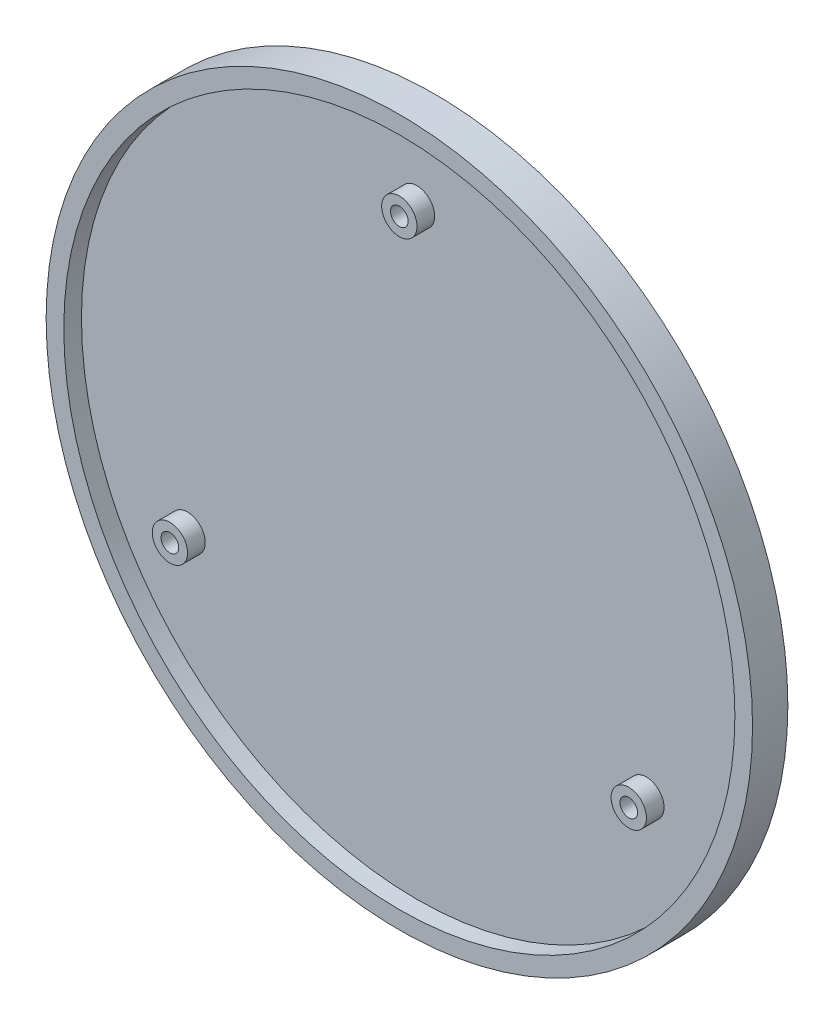
ISO-10303-21;
HEADER;
FILE_DESCRIPTION(('STEP AP214'),'2;1');
FILE_NAME('part.step','',(''),(''),'','','');
FILE_SCHEMA(('AUTOMOTIVE_DESIGN { 1 0 10303 214 1 1 1 1 }'));
ENDSEC;
DATA;
#1=APPLICATION_CONTEXT('core data for automotive mechanical design processes');
#2=APPLICATION_PROTOCOL_DEFINITION('international standard','automotive_design',2000,#1);
#3=PRODUCT_CONTEXT('',#1,'mechanical');
#4=PRODUCT('Part','Part','',(#3));
#5=PRODUCT_RELATED_PRODUCT_CATEGORY('part','',(#4));
#6=PRODUCT_DEFINITION_FORMATION('','',#4);
#7=PRODUCT_DEFINITION_CONTEXT('part definition',#1,'design');
#8=PRODUCT_DEFINITION('design','',#6,#7);
#9=PRODUCT_DEFINITION_SHAPE('','',#8);
#10=(LENGTH_UNIT() NAMED_UNIT(*) SI_UNIT(.MILLI.,.METRE.));
#11=(NAMED_UNIT(*) PLANE_ANGLE_UNIT() SI_UNIT($,.RADIAN.));
#12=(NAMED_UNIT(*) SI_UNIT($,.STERADIAN.) SOLID_ANGLE_UNIT());
#13=UNCERTAINTY_MEASURE_WITH_UNIT(LENGTH_MEASURE(1.E-05),#10,'distance_accuracy_value','');
#14=(GEOMETRIC_REPRESENTATION_CONTEXT(3) GLOBAL_UNCERTAINTY_ASSIGNED_CONTEXT((#13)) GLOBAL_UNIT_ASSIGNED_CONTEXT((#10,
#11,#12)) REPRESENTATION_CONTEXT('',''));
#15=CARTESIAN_POINT('',(0.,0.,0.));
#16=DIRECTION('',(0.,0.,1.));
#17=DIRECTION('',(1.,0.,0.));
#18=AXIS2_PLACEMENT_3D('',#15,#16,#17);
#19=CARTESIAN_POINT('',(0.,30.,4.));
#20=DIRECTION('',(0.,0.,-1.));
#21=DIRECTION('',(-1.,0.,0.));
#22=AXIS2_PLACEMENT_3D('',#19,#20,#21);
#23=CYLINDRICAL_SURFACE('',#22,1.);
#24=CARTESIAN_POINT('',(0.,30.,4.));
#25=DIRECTION('',(0.,0.,1.));
#26=DIRECTION('',(1.,0.,0.));
#27=AXIS2_PLACEMENT_3D('',#24,#25,#26);
#28=CIRCLE('',#27,1.);
#29=CARTESIAN_POINT('',(1.,30.,4.));
#30=VERTEX_POINT('',#29);
#31=EDGE_CURVE('E97',#30,#30,#28,.T.);
#32=ORIENTED_EDGE('',*,*,#31,.T.);
#33=EDGE_LOOP('',(#32));
#34=FACE_BOUND('',#33,.T.);
#35=CARTESIAN_POINT('',(0.,30.,1.2));
#36=DIRECTION('',(0.,0.,-1.));
#37=DIRECTION('',(-1.,0.,0.));
#38=AXIS2_PLACEMENT_3D('',#35,#36,#37);
#39=CIRCLE('',#38,1.);
#40=CARTESIAN_POINT('',(-1.,30.,1.2));
#41=VERTEX_POINT('',#40);
#42=EDGE_CURVE('E41',#41,#41,#39,.T.);
#43=ORIENTED_EDGE('',*,*,#42,.T.);
#44=EDGE_LOOP('',(#43));
#45=FACE_BOUND('',#44,.T.);
#46=ADVANCED_FACE('F37',(#34,#45),#23,.F.);
#47=CARTESIAN_POINT('',(25.9807621135364,-14.9999999999981,4.));
#48=DIRECTION('',(0.,0.,-1.));
#49=DIRECTION('',(-1.,0.,0.));
#50=AXIS2_PLACEMENT_3D('',#47,#48,#49);
#51=CYLINDRICAL_SURFACE('',#50,1.00000000000267);
#52=CARTESIAN_POINT('',(25.9807621135364,-14.9999999999981,4.));
#53=DIRECTION('',(0.,0.,1.));
#54=DIRECTION('',(1.,0.,0.));
#55=AXIS2_PLACEMENT_3D('',#52,#53,#54);
#56=CIRCLE('',#55,1.00000000000267);
#57=CARTESIAN_POINT('',(26.980762113539,-14.9999999999981,4.));
#58=VERTEX_POINT('',#57);
#59=EDGE_CURVE('E87',#58,#58,#56,.T.);
#60=ORIENTED_EDGE('',*,*,#59,.T.);
#61=EDGE_LOOP('',(#60));
#62=FACE_BOUND('',#61,.T.);
#63=CARTESIAN_POINT('',(25.9807621135364,-14.9999999999981,1.2));
#64=DIRECTION('',(0.,0.,-1.));
#65=DIRECTION('',(-1.,0.,0.));
#66=AXIS2_PLACEMENT_3D('',#63,#64,#65);
#67=CIRCLE('',#66,1.00000000000267);
#68=CARTESIAN_POINT('',(24.9807621135337,-14.9999999999981,1.2));
#69=VERTEX_POINT('',#68);
#70=EDGE_CURVE('E60',#69,#69,#67,.T.);
#71=ORIENTED_EDGE('',*,*,#70,.T.);
#72=EDGE_LOOP('',(#71));
#73=FACE_BOUND('',#72,.T.);
#74=ADVANCED_FACE('F136',(#62,#73),#51,.F.);
#75=CARTESIAN_POINT('',(-25.98076211353,-15.0000000000019,4.));
#76=DIRECTION('',(0.,0.,-1.));
#77=DIRECTION('',(-1.,0.,0.));
#78=AXIS2_PLACEMENT_3D('',#75,#76,#77);
#79=CYLINDRICAL_SURFACE('',#78,1.00000000000387);
#80=CARTESIAN_POINT('',(-25.98076211353,-15.0000000000019,4.));
#81=DIRECTION('',(0.,0.,1.));
#82=DIRECTION('',(1.,0.,0.));
#83=AXIS2_PLACEMENT_3D('',#80,#81,#82);
#84=CIRCLE('',#83,1.00000000000387);
#85=CARTESIAN_POINT('',(-24.9807621135261,-15.0000000000019,4.));
#86=VERTEX_POINT('',#85);
#87=EDGE_CURVE('E68',#86,#86,#84,.T.);
#88=ORIENTED_EDGE('',*,*,#87,.T.);
#89=EDGE_LOOP('',(#88));
#90=FACE_BOUND('',#89,.T.);
#91=CARTESIAN_POINT('',(-25.98076211353,-15.0000000000019,1.2));
#92=DIRECTION('',(0.,0.,-1.));
#93=DIRECTION('',(-1.,0.,0.));
#94=AXIS2_PLACEMENT_3D('',#91,#92,#93);
#95=CIRCLE('',#94,1.00000000000387);
#96=CARTESIAN_POINT('',(-26.9807621135338,-15.0000000000019,1.2));
#97=VERTEX_POINT('',#96);
#98=EDGE_CURVE('E57',#97,#97,#95,.T.);
#99=ORIENTED_EDGE('',*,*,#98,.T.);
#100=EDGE_LOOP('',(#99));
#101=FACE_BOUND('',#100,.T.);
#102=ADVANCED_FACE('F132',(#90,#101),#79,.F.);
#103=CARTESIAN_POINT('',(0.,0.,4.));
#104=DIRECTION('',(0.,0.,-1.));
#105=DIRECTION('',(-1.,0.,0.));
#106=AXIS2_PLACEMENT_3D('',#103,#104,#105);
#107=CYLINDRICAL_SURFACE('',#106,40.);
#108=CARTESIAN_POINT('',(0.,0.,4.));
#109=DIRECTION('',(0.,0.,1.));
#110=DIRECTION('',(1.,0.,0.));
#111=AXIS2_PLACEMENT_3D('',#108,#109,#110);
#112=CIRCLE('',#111,40.);
#113=CARTESIAN_POINT('',(40.,0.,4.));
#114=VERTEX_POINT('',#113);
#115=EDGE_CURVE('E10',#114,#114,#112,.T.);
#116=ORIENTED_EDGE('',*,*,#115,.F.);
#117=EDGE_LOOP('',(#116));
#118=FACE_BOUND('',#117,.T.);
#119=CARTESIAN_POINT('',(0.,0.,0.));
#120=DIRECTION('',(0.,0.,1.));
#121=DIRECTION('',(1.,0.,0.));
#122=AXIS2_PLACEMENT_3D('',#119,#120,#121);
#123=CIRCLE('',#122,40.);
#124=CARTESIAN_POINT('',(40.,0.,0.));
#125=VERTEX_POINT('',#124);
#126=EDGE_CURVE('E46',#125,#125,#123,.T.);
#127=ORIENTED_EDGE('',*,*,#126,.T.);
#128=EDGE_LOOP('',(#127));
#129=FACE_BOUND('',#128,.T.);
#130=ADVANCED_FACE('F39',(#118,#129),#107,.T.);
#131=CARTESIAN_POINT('',(0.,0.,4.));
#132=DIRECTION('',(0.,0.,1.));
#133=DIRECTION('',(1.,0.,0.));
#134=AXIS2_PLACEMENT_3D('',#131,#132,#133);
#135=PLANE('',#134);
#136=CARTESIAN_POINT('',(0.,0.,4.));
#137=DIRECTION('',(0.,0.,1.));
#138=DIRECTION('',(1.,0.,0.));
#139=AXIS2_PLACEMENT_3D('',#136,#137,#138);
#140=CIRCLE('',#139,38.);
#141=CARTESIAN_POINT('',(38.,0.,4.));
#142=VERTEX_POINT('',#141);
#143=EDGE_CURVE('E52',#142,#142,#140,.T.);
#144=ORIENTED_EDGE('',*,*,#143,.F.);
#145=EDGE_LOOP('',(#144));
#146=FACE_BOUND('',#145,.T.);
#147=ORIENTED_EDGE('',*,*,#115,.T.);
#148=EDGE_LOOP('',(#147));
#149=FACE_BOUND('',#148,.T.);
#150=ADVANCED_FACE('F123',(#146,#149),#135,.T.);
#151=CARTESIAN_POINT('',(0.,0.,0.));
#152=DIRECTION('',(0.,0.,1.));
#153=DIRECTION('',(1.,0.,0.));
#154=AXIS2_PLACEMENT_3D('',#151,#152,#153);
#155=PLANE('',#154);
#156=CARTESIAN_POINT('',(25.9807621135364,-14.9999999999981,0.));
#157=DIRECTION('',(0.,0.,-1.));
#158=DIRECTION('',(-1.,0.,0.));
#159=AXIS2_PLACEMENT_3D('',#156,#157,#158);
#160=CIRCLE('',#159,1.6);
#161=CARTESIAN_POINT('',(24.3807621135364,-14.9999999999981,0.));
#162=VERTEX_POINT('',#161);
#163=EDGE_CURVE('E221',#162,#162,#160,.T.);
#164=ORIENTED_EDGE('',*,*,#163,.F.);
#165=EDGE_LOOP('',(#164));
#166=FACE_BOUND('',#165,.T.);
#167=CARTESIAN_POINT('',(0.,30.,0.));
#168=DIRECTION('',(0.,0.,-1.));
#169=DIRECTION('',(-1.,0.,0.));
#170=AXIS2_PLACEMENT_3D('',#167,#168,#169);
#171=CIRCLE('',#170,1.6);
#172=CARTESIAN_POINT('',(-1.6,30.,0.));
#173=VERTEX_POINT('',#172);
#174=EDGE_CURVE('E231',#173,#173,#171,.T.);
#175=ORIENTED_EDGE('',*,*,#174,.F.);
#176=EDGE_LOOP('',(#175));
#177=FACE_BOUND('',#176,.T.);
#178=CARTESIAN_POINT('',(-25.98076211353,-15.0000000000019,0.));
#179=DIRECTION('',(0.,0.,-1.));
#180=DIRECTION('',(-1.,0.,0.));
#181=AXIS2_PLACEMENT_3D('',#178,#179,#180);
#182=CIRCLE('',#181,1.6);
#183=CARTESIAN_POINT('',(-27.58076211353,-15.0000000000019,0.));
#184=VERTEX_POINT('',#183);
#185=EDGE_CURVE('E83',#184,#184,#182,.T.);
#186=ORIENTED_EDGE('',*,*,#185,.F.);
#187=EDGE_LOOP('',(#186));
#188=FACE_BOUND('',#187,.T.);
#189=ORIENTED_EDGE('',*,*,#126,.F.);
#190=EDGE_LOOP('',(#189));
#191=FACE_BOUND('',#190,.T.);
#192=ADVANCED_FACE('F125',(#166,#177,#188,#191),#155,.F.);
#193=CARTESIAN_POINT('',(0.,0.,4.));
#194=DIRECTION('',(0.,0.,-1.));
#195=DIRECTION('',(-1.,0.,0.));
#196=AXIS2_PLACEMENT_3D('',#193,#194,#195);
#197=CYLINDRICAL_SURFACE('',#196,38.);
#198=ORIENTED_EDGE('',*,*,#143,.T.);
#199=EDGE_LOOP('',(#198));
#200=FACE_BOUND('',#199,.T.);
#201=CARTESIAN_POINT('',(0.,0.,2.));
#202=DIRECTION('',(0.,0.,1.));
#203=DIRECTION('',(1.,0.,0.));
#204=AXIS2_PLACEMENT_3D('',#201,#202,#203);
#205=CIRCLE('',#204,38.);
#206=CARTESIAN_POINT('',(38.,0.,2.));
#207=VERTEX_POINT('',#206);
#208=EDGE_CURVE('E109',#207,#207,#205,.T.);
#209=ORIENTED_EDGE('',*,*,#208,.F.);
#210=EDGE_LOOP('',(#209));
#211=FACE_BOUND('',#210,.T.);
#212=ADVANCED_FACE('F120',(#200,#211),#197,.F.);
#213=CARTESIAN_POINT('',(0.,0.,2.));
#214=DIRECTION('',(0.,0.,1.));
#215=DIRECTION('',(1.,0.,0.));
#216=AXIS2_PLACEMENT_3D('',#213,#214,#215);
#217=PLANE('',#216);
#218=CARTESIAN_POINT('',(-25.98076211353,-15.0000000000019,2.));
#219=DIRECTION('',(0.,0.,1.));
#220=DIRECTION('',(1.,0.,0.));
#221=AXIS2_PLACEMENT_3D('',#218,#219,#220);
#222=CIRCLE('',#221,2.00000000000387);
#223=CARTESIAN_POINT('',(-23.9807621135261,-15.0000000000019,2.));
#224=VERTEX_POINT('',#223);
#225=EDGE_CURVE('E73',#224,#224,#222,.T.);
#226=ORIENTED_EDGE('',*,*,#225,.F.);
#227=EDGE_LOOP('',(#226));
#228=FACE_BOUND('',#227,.T.);
#229=CARTESIAN_POINT('',(25.9807621135364,-14.9999999999981,2.));
#230=DIRECTION('',(0.,0.,1.));
#231=DIRECTION('',(1.,0.,0.));
#232=AXIS2_PLACEMENT_3D('',#229,#230,#231);
#233=CIRCLE('',#232,2.00000000000267);
#234=CARTESIAN_POINT('',(27.980762113539,-14.9999999999981,2.));
#235=VERTEX_POINT('',#234);
#236=EDGE_CURVE('E92',#235,#235,#233,.T.);
#237=ORIENTED_EDGE('',*,*,#236,.F.);
#238=EDGE_LOOP('',(#237));
#239=FACE_BOUND('',#238,.T.);
#240=CARTESIAN_POINT('',(0.,30.,2.));
#241=DIRECTION('',(0.,0.,1.));
#242=DIRECTION('',(1.,0.,0.));
#243=AXIS2_PLACEMENT_3D('',#240,#241,#242);
#244=CIRCLE('',#243,2.);
#245=CARTESIAN_POINT('',(2.,30.,2.));
#246=VERTEX_POINT('',#245);
#247=EDGE_CURVE('E104',#246,#246,#244,.T.);
#248=ORIENTED_EDGE('',*,*,#247,.F.);
#249=EDGE_LOOP('',(#248));
#250=FACE_BOUND('',#249,.T.);
#251=ORIENTED_EDGE('',*,*,#208,.T.);
#252=EDGE_LOOP('',(#251));
#253=FACE_BOUND('',#252,.T.);
#254=ADVANCED_FACE('F152',(#228,#239,#250,#253),#217,.T.);
#255=CARTESIAN_POINT('',(0.,30.,4.));
#256=DIRECTION('',(0.,0.,1.));
#257=DIRECTION('',(1.,0.,0.));
#258=AXIS2_PLACEMENT_3D('',#255,#256,#257);
#259=PLANE('',#258);
#260=CARTESIAN_POINT('',(0.,30.,4.));
#261=DIRECTION('',(0.,0.,1.));
#262=DIRECTION('',(1.,0.,0.));
#263=AXIS2_PLACEMENT_3D('',#260,#261,#262);
#264=CIRCLE('',#263,2.);
#265=CARTESIAN_POINT('',(2.,30.,4.));
#266=VERTEX_POINT('',#265);
#267=EDGE_CURVE('E105',#266,#266,#264,.T.);
#268=ORIENTED_EDGE('',*,*,#267,.T.);
#269=EDGE_LOOP('',(#268));
#270=FACE_BOUND('',#269,.T.);
#271=ORIENTED_EDGE('',*,*,#31,.F.);
#272=EDGE_LOOP('',(#271));
#273=FACE_BOUND('',#272,.T.);
#274=ADVANCED_FACE('F148',(#270,#273),#259,.T.);
#275=CARTESIAN_POINT('',(0.,30.,4.));
#276=DIRECTION('',(0.,0.,-1.));
#277=DIRECTION('',(-1.,0.,0.));
#278=AXIS2_PLACEMENT_3D('',#275,#276,#277);
#279=CYLINDRICAL_SURFACE('',#278,2.);
#280=ORIENTED_EDGE('',*,*,#267,.F.);
#281=EDGE_LOOP('',(#280));
#282=FACE_BOUND('',#281,.T.);
#283=ORIENTED_EDGE('',*,*,#247,.T.);
#284=EDGE_LOOP('',(#283));
#285=FACE_BOUND('',#284,.T.);
#286=ADVANCED_FACE('F151',(#282,#285),#279,.T.);
#287=CARTESIAN_POINT('',(25.9807621135364,-14.9999999999981,4.));
#288=DIRECTION('',(0.,0.,1.));
#289=DIRECTION('',(1.,0.,0.));
#290=AXIS2_PLACEMENT_3D('',#287,#288,#289);
#291=PLANE('',#290);
#292=CARTESIAN_POINT('',(25.9807621135364,-14.9999999999981,4.));
#293=DIRECTION('',(0.,0.,1.));
#294=DIRECTION('',(1.,0.,0.));
#295=AXIS2_PLACEMENT_3D('',#292,#293,#294);
#296=CIRCLE('',#295,2.00000000000267);
#297=CARTESIAN_POINT('',(27.980762113539,-14.9999999999981,4.));
#298=VERTEX_POINT('',#297);
#299=EDGE_CURVE('E93',#298,#298,#296,.T.);
#300=ORIENTED_EDGE('',*,*,#299,.T.);
#301=EDGE_LOOP('',(#300));
#302=FACE_BOUND('',#301,.T.);
#303=ORIENTED_EDGE('',*,*,#59,.F.);
#304=EDGE_LOOP('',(#303));
#305=FACE_BOUND('',#304,.T.);
#306=ADVANCED_FACE('F156',(#302,#305),#291,.T.);
#307=CARTESIAN_POINT('',(25.9807621135364,-14.9999999999981,4.));
#308=DIRECTION('',(0.,0.,-1.));
#309=DIRECTION('',(-1.,0.,0.));
#310=AXIS2_PLACEMENT_3D('',#307,#308,#309);
#311=CYLINDRICAL_SURFACE('',#310,2.00000000000267);
#312=ORIENTED_EDGE('',*,*,#299,.F.);
#313=EDGE_LOOP('',(#312));
#314=FACE_BOUND('',#313,.T.);
#315=ORIENTED_EDGE('',*,*,#236,.T.);
#316=EDGE_LOOP('',(#315));
#317=FACE_BOUND('',#316,.T.);
#318=ADVANCED_FACE('F146',(#314,#317),#311,.T.);
#319=CARTESIAN_POINT('',(-25.98076211353,-15.0000000000019,4.));
#320=DIRECTION('',(0.,0.,1.));
#321=DIRECTION('',(1.,0.,0.));
#322=AXIS2_PLACEMENT_3D('',#319,#320,#321);
#323=PLANE('',#322);
#324=CARTESIAN_POINT('',(-25.98076211353,-15.0000000000019,4.));
#325=DIRECTION('',(0.,0.,1.));
#326=DIRECTION('',(1.,0.,0.));
#327=AXIS2_PLACEMENT_3D('',#324,#325,#326);
#328=CIRCLE('',#327,2.00000000000387);
#329=CARTESIAN_POINT('',(-23.9807621135261,-15.0000000000019,4.));
#330=VERTEX_POINT('',#329);
#331=EDGE_CURVE('E79',#330,#330,#328,.T.);
#332=ORIENTED_EDGE('',*,*,#331,.T.);
#333=EDGE_LOOP('',(#332));
#334=FACE_BOUND('',#333,.T.);
#335=ORIENTED_EDGE('',*,*,#87,.F.);
#336=EDGE_LOOP('',(#335));
#337=FACE_BOUND('',#336,.T.);
#338=ADVANCED_FACE('F171',(#334,#337),#323,.T.);
#339=CARTESIAN_POINT('',(-25.98076211353,-15.0000000000019,4.));
#340=DIRECTION('',(0.,0.,-1.));
#341=DIRECTION('',(-1.,0.,0.));
#342=AXIS2_PLACEMENT_3D('',#339,#340,#341);
#343=CYLINDRICAL_SURFACE('',#342,2.00000000000387);
#344=ORIENTED_EDGE('',*,*,#331,.F.);
#345=EDGE_LOOP('',(#344));
#346=FACE_BOUND('',#345,.T.);
#347=ORIENTED_EDGE('',*,*,#225,.T.);
#348=EDGE_LOOP('',(#347));
#349=FACE_BOUND('',#348,.T.);
#350=ADVANCED_FACE('F177',(#346,#349),#343,.T.);
#351=CARTESIAN_POINT('',(-25.98076211353,-15.0000000000019,1.2));
#352=DIRECTION('',(0.,0.,-1.));
#353=DIRECTION('',(-1.,0.,0.));
#354=AXIS2_PLACEMENT_3D('',#351,#352,#353);
#355=CYLINDRICAL_SURFACE('',#354,1.6);
#356=CARTESIAN_POINT('',(-25.98076211353,-15.0000000000019,1.2));
#357=DIRECTION('',(0.,0.,-1.));
#358=DIRECTION('',(-1.,0.,0.));
#359=AXIS2_PLACEMENT_3D('',#356,#357,#358);
#360=CIRCLE('',#359,1.6);
#361=CARTESIAN_POINT('',(-27.58076211353,-15.0000000000019,1.2));
#362=VERTEX_POINT('',#361);
#363=EDGE_CURVE('E234',#362,#362,#360,.T.);
#364=ORIENTED_EDGE('',*,*,#363,.F.);
#365=EDGE_LOOP('',(#364));
#366=FACE_BOUND('',#365,.T.);
#367=ORIENTED_EDGE('',*,*,#185,.T.);
#368=EDGE_LOOP('',(#367));
#369=FACE_BOUND('',#368,.T.);
#370=ADVANCED_FACE('F188',(#366,#369),#355,.F.);
#371=CARTESIAN_POINT('',(-25.98076211353,-15.0000000000019,1.2));
#372=DIRECTION('',(0.,0.,-1.));
#373=DIRECTION('',(-1.,0.,0.));
#374=AXIS2_PLACEMENT_3D('',#371,#372,#373);
#375=PLANE('',#374);
#376=ORIENTED_EDGE('',*,*,#98,.F.);
#377=EDGE_LOOP('',(#376));
#378=FACE_BOUND('',#377,.T.);
#379=ORIENTED_EDGE('',*,*,#363,.T.);
#380=EDGE_LOOP('',(#379));
#381=FACE_BOUND('',#380,.T.);
#382=ADVANCED_FACE('F195',(#378,#381),#375,.T.);
#383=CARTESIAN_POINT('',(25.9807621135364,-14.9999999999981,1.2));
#384=DIRECTION('',(0.,0.,-1.));
#385=DIRECTION('',(-1.,0.,0.));
#386=AXIS2_PLACEMENT_3D('',#383,#384,#385);
#387=CYLINDRICAL_SURFACE('',#386,1.6);
#388=CARTESIAN_POINT('',(25.9807621135364,-14.9999999999981,1.2));
#389=DIRECTION('',(0.,0.,-1.));
#390=DIRECTION('',(-1.,0.,0.));
#391=AXIS2_PLACEMENT_3D('',#388,#389,#390);
#392=CIRCLE('',#391,1.6);
#393=CARTESIAN_POINT('',(24.3807621135364,-14.9999999999981,1.2));
#394=VERTEX_POINT('',#393);
#395=EDGE_CURVE('E61',#394,#394,#392,.T.);
#396=ORIENTED_EDGE('',*,*,#395,.F.);
#397=EDGE_LOOP('',(#396));
#398=FACE_BOUND('',#397,.T.);
#399=ORIENTED_EDGE('',*,*,#163,.T.);
#400=EDGE_LOOP('',(#399));
#401=FACE_BOUND('',#400,.T.);
#402=ADVANCED_FACE('F199',(#398,#401),#387,.F.);
#403=CARTESIAN_POINT('',(25.9807621135364,-14.9999999999981,1.2));
#404=DIRECTION('',(0.,0.,-1.));
#405=DIRECTION('',(-1.,0.,0.));
#406=AXIS2_PLACEMENT_3D('',#403,#404,#405);
#407=PLANE('',#406);
#408=ORIENTED_EDGE('',*,*,#70,.F.);
#409=EDGE_LOOP('',(#408));
#410=FACE_BOUND('',#409,.T.);
#411=ORIENTED_EDGE('',*,*,#395,.T.);
#412=EDGE_LOOP('',(#411));
#413=FACE_BOUND('',#412,.T.);
#414=ADVANCED_FACE('F205',(#410,#413),#407,.T.);
#415=CARTESIAN_POINT('',(0.,30.,1.2));
#416=DIRECTION('',(0.,0.,-1.));
#417=DIRECTION('',(-1.,0.,0.));
#418=AXIS2_PLACEMENT_3D('',#415,#416,#417);
#419=CYLINDRICAL_SURFACE('',#418,1.6);
#420=CARTESIAN_POINT('',(0.,30.,1.2));
#421=DIRECTION('',(0.,0.,-1.));
#422=DIRECTION('',(-1.,0.,0.));
#423=AXIS2_PLACEMENT_3D('',#420,#421,#422);
#424=CIRCLE('',#423,1.6);
#425=CARTESIAN_POINT('',(-1.6,30.,1.2));
#426=VERTEX_POINT('',#425);
#427=EDGE_CURVE('E225',#426,#426,#424,.T.);
#428=ORIENTED_EDGE('',*,*,#427,.F.);
#429=EDGE_LOOP('',(#428));
#430=FACE_BOUND('',#429,.T.);
#431=ORIENTED_EDGE('',*,*,#174,.T.);
#432=EDGE_LOOP('',(#431));
#433=FACE_BOUND('',#432,.T.);
#434=ADVANCED_FACE('F201',(#430,#433),#419,.F.);
#435=CARTESIAN_POINT('',(0.,30.,1.2));
#436=DIRECTION('',(0.,0.,-1.));
#437=DIRECTION('',(-1.,0.,0.));
#438=AXIS2_PLACEMENT_3D('',#435,#436,#437);
#439=PLANE('',#438);
#440=ORIENTED_EDGE('',*,*,#42,.F.);
#441=EDGE_LOOP('',(#440));
#442=FACE_BOUND('',#441,.T.);
#443=ORIENTED_EDGE('',*,*,#427,.T.);
#444=EDGE_LOOP('',(#443));
#445=FACE_BOUND('',#444,.T.);
#446=ADVANCED_FACE('F204',(#442,#445),#439,.T.);
#447=CLOSED_SHELL('',(#46,#74,#102,#130,#150,#192,#212,#254,#274,#286,#306,#318,#338,#350,#370,
#382,#402,#414,#434,#446));
#448=MANIFOLD_SOLID_BREP('B2',#447);
#449=ADVANCED_BREP_SHAPE_REPRESENTATION('',(#18,#448),#14);
#450=SHAPE_DEFINITION_REPRESENTATION(#9,#449);
ENDSEC;
END-ISO-10303-21;
